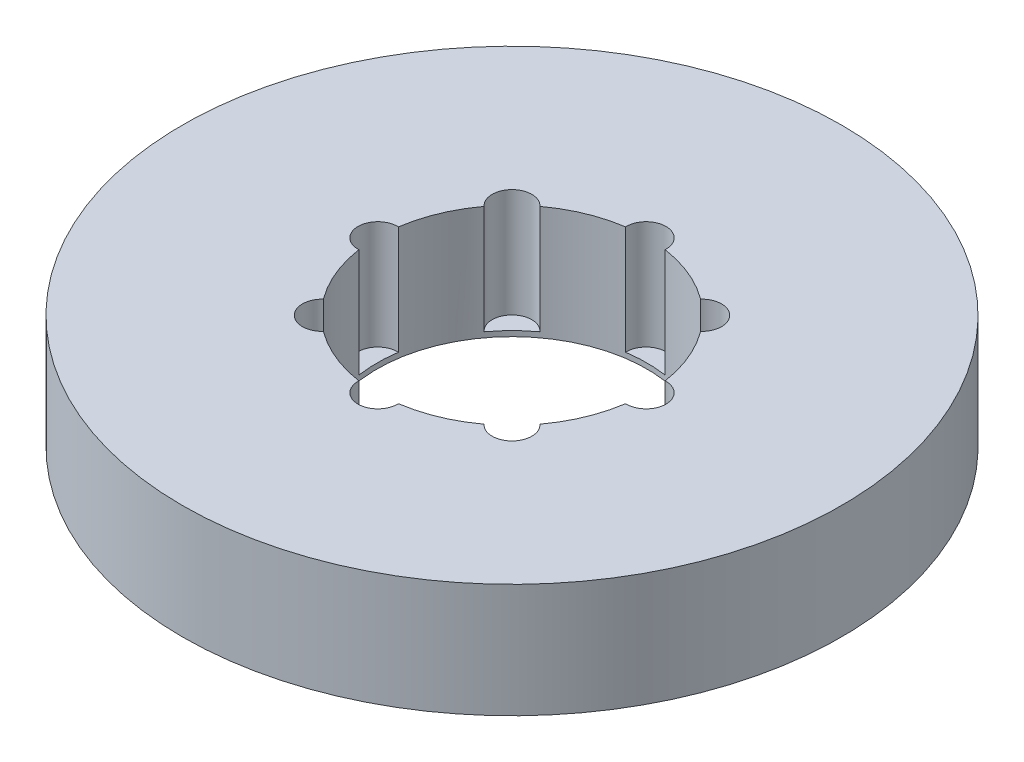
ISO-10303-21;
HEADER;
FILE_DESCRIPTION(('STEP AP214'),'2;1');
FILE_NAME('part.step','',(''),(''),'','','');
FILE_SCHEMA(('AUTOMOTIVE_DESIGN { 1 0 10303 214 1 1 1 1 }'));
ENDSEC;
DATA;
#1=APPLICATION_CONTEXT('core data for automotive mechanical design processes');
#2=APPLICATION_PROTOCOL_DEFINITION('international standard','automotive_design',2000,#1);
#3=PRODUCT_CONTEXT('',#1,'mechanical');
#4=PRODUCT('Part','Part','',(#3));
#5=PRODUCT_RELATED_PRODUCT_CATEGORY('part','',(#4));
#6=PRODUCT_DEFINITION_FORMATION('','',#4);
#7=PRODUCT_DEFINITION_CONTEXT('part definition',#1,'design');
#8=PRODUCT_DEFINITION('design','',#6,#7);
#9=PRODUCT_DEFINITION_SHAPE('','',#8);
#10=(LENGTH_UNIT() NAMED_UNIT(*) SI_UNIT(.MILLI.,.METRE.));
#11=(NAMED_UNIT(*) PLANE_ANGLE_UNIT() SI_UNIT($,.RADIAN.));
#12=(NAMED_UNIT(*) SI_UNIT($,.STERADIAN.) SOLID_ANGLE_UNIT());
#13=UNCERTAINTY_MEASURE_WITH_UNIT(LENGTH_MEASURE(1.E-05),#10,'distance_accuracy_value','');
#14=(GEOMETRIC_REPRESENTATION_CONTEXT(3) GLOBAL_UNCERTAINTY_ASSIGNED_CONTEXT((#13)) GLOBAL_UNIT_ASSIGNED_CONTEXT((#10,
#11,#12)) REPRESENTATION_CONTEXT('',''));
#15=CARTESIAN_POINT('',(0.,0.,0.));
#16=DIRECTION('',(0.,0.,1.));
#17=DIRECTION('',(1.,0.,0.));
#18=AXIS2_PLACEMENT_3D('',#15,#16,#17);
#19=CARTESIAN_POINT('',(0.,19.,0.));
#20=DIRECTION('',(0.,-1.,0.));
#21=DIRECTION('',(0.,0.,-1.));
#22=AXIS2_PLACEMENT_3D('',#19,#20,#21);
#23=CYLINDRICAL_SURFACE('',#22,55.);
#24=CARTESIAN_POINT('',(0.,19.,0.));
#25=DIRECTION('',(0.,1.,0.));
#26=DIRECTION('',(0.,0.,1.));
#27=AXIS2_PLACEMENT_3D('',#24,#25,#26);
#28=CIRCLE('',#27,55.);
#29=CARTESIAN_POINT('',(0.,19.,55.));
#30=VERTEX_POINT('',#29);
#31=EDGE_CURVE('E195',#30,#30,#28,.T.);
#32=ORIENTED_EDGE('',*,*,#31,.F.);
#33=EDGE_LOOP('',(#32));
#34=FACE_BOUND('',#33,.T.);
#35=CARTESIAN_POINT('',(0.,0.,0.));
#36=DIRECTION('',(0.,1.,0.));
#37=DIRECTION('',(0.,0.,1.));
#38=AXIS2_PLACEMENT_3D('',#35,#36,#37);
#39=CIRCLE('',#38,55.);
#40=CARTESIAN_POINT('',(0.,0.,55.));
#41=VERTEX_POINT('',#40);
#42=EDGE_CURVE('E179',#41,#41,#39,.T.);
#43=ORIENTED_EDGE('',*,*,#42,.T.);
#44=EDGE_LOOP('',(#43));
#45=FACE_BOUND('',#44,.T.);
#46=ADVANCED_FACE('F39',(#34,#45),#23,.T.);
#47=CARTESIAN_POINT('',(0.,19.,0.));
#48=DIRECTION('',(0.,1.,0.));
#49=DIRECTION('',(0.,0.,1.));
#50=AXIS2_PLACEMENT_3D('',#47,#48,#49);
#51=PLANE('',#50);
#52=CARTESIAN_POINT('',(0.,19.,22.3926226197725));
#53=DIRECTION('',(0.,1.,0.));
#54=DIRECTION('',(1.,0.,0.));
#55=AXIS2_PLACEMENT_3D('',#52,#53,#54);
#56=CIRCLE('',#55,3.3011017216078);
#57=CARTESIAN_POINT('',(-3.29831189292121,19.,22.2569346195071));
#58=VERTEX_POINT('',#57);
#59=CARTESIAN_POINT('',(3.29831189292136,19.,22.2569346195071));
#60=VERTEX_POINT('',#59);
#61=EDGE_CURVE('E176',#58,#60,#56,.T.);
#62=ORIENTED_EDGE('',*,*,#61,.F.);
#63=CARTESIAN_POINT('',(0.,19.,0.));
#64=DIRECTION('',(0.,1.,0.));
#65=DIRECTION('',(0.,0.,1.));
#66=AXIS2_PLACEMENT_3D('',#63,#64,#65);
#67=CIRCLE('',#66,22.5);
#68=CARTESIAN_POINT('',(-13.4057706919262,19.,18.070288103832));
#69=VERTEX_POINT('',#68);
#70=EDGE_CURVE('E166',#69,#58,#67,.T.);
#71=ORIENTED_EDGE('',*,*,#70,.F.);
#72=CARTESIAN_POINT('',(-15.8339753029924,19.,15.8339753029924));
#73=DIRECTION('',(0.,1.,0.));
#74=DIRECTION('',(0.707106781186549,0.,0.707106781186546));
#75=AXIS2_PLACEMENT_3D('',#72,#73,#74);
#76=CIRCLE('',#75,3.3011017216078);
#77=CARTESIAN_POINT('',(-18.070288103832,19.,13.4057706919263));
#78=VERTEX_POINT('',#77);
#79=EDGE_CURVE('E147',#78,#69,#76,.T.);
#80=ORIENTED_EDGE('',*,*,#79,.F.);
#81=CARTESIAN_POINT('',(-22.2569346195071,19.,3.29831189292129));
#82=VERTEX_POINT('',#81);
#83=EDGE_CURVE('E180',#82,#78,#67,.T.);
#84=ORIENTED_EDGE('',*,*,#83,.F.);
#85=CARTESIAN_POINT('',(-22.3926226197725,19.,0.));
#86=DIRECTION('',(0.,1.,0.));
#87=DIRECTION('',(0.,0.,1.));
#88=AXIS2_PLACEMENT_3D('',#85,#86,#87);
#89=CIRCLE('',#88,3.3011017216078);
#90=CARTESIAN_POINT('',(-22.2569346195071,19.,-3.29831189292129));
#91=VERTEX_POINT('',#90);
#92=EDGE_CURVE('E186',#91,#82,#89,.T.);
#93=ORIENTED_EDGE('',*,*,#92,.F.);
#94=CARTESIAN_POINT('',(-18.0702881038322,19.,-13.405770691926));
#95=VERTEX_POINT('',#94);
#96=EDGE_CURVE('E182',#95,#91,#67,.T.);
#97=ORIENTED_EDGE('',*,*,#96,.F.);
#98=CARTESIAN_POINT('',(-15.8339753029926,19.,-15.8339753029922));
#99=DIRECTION('',(0.,1.,0.));
#100=DIRECTION('',(-0.707106781186539,0.,0.707106781186556));
#101=AXIS2_PLACEMENT_3D('',#98,#99,#100);
#102=CIRCLE('',#101,3.3011017216078);
#103=CARTESIAN_POINT('',(-13.4057706919264,19.,-18.0702881038318));
#104=VERTEX_POINT('',#103);
#105=EDGE_CURVE('E446',#104,#95,#102,.T.);
#106=ORIENTED_EDGE('',*,*,#105,.F.);
#107=CARTESIAN_POINT('',(-3.29831189292152,19.,-22.2569346195071));
#108=VERTEX_POINT('',#107);
#109=EDGE_CURVE('E452',#108,#104,#67,.T.);
#110=ORIENTED_EDGE('',*,*,#109,.F.);
#111=CARTESIAN_POINT('',(-2.34550272014077E-13,19.,-22.3926226197725));
#112=DIRECTION('',(0.,1.,0.));
#113=DIRECTION('',(-1.,0.,0.));
#114=AXIS2_PLACEMENT_3D('',#111,#112,#113);
#115=CIRCLE('',#114,3.3011017216078);
#116=CARTESIAN_POINT('',(3.29831189292105,19.,-22.2569346195071));
#117=VERTEX_POINT('',#116);
#118=EDGE_CURVE('E477',#117,#108,#115,.T.);
#119=ORIENTED_EDGE('',*,*,#118,.F.);
#120=CARTESIAN_POINT('',(13.4057706919261,19.,-18.0702881038321));
#121=VERTEX_POINT('',#120);
#122=EDGE_CURVE('E460',#121,#117,#67,.T.);
#123=ORIENTED_EDGE('',*,*,#122,.F.);
#124=CARTESIAN_POINT('',(15.8339753029923,19.,-15.8339753029925));
#125=DIRECTION('',(0.,1.,0.));
#126=DIRECTION('',(-0.707106781186554,0.,-0.707106781186541));
#127=AXIS2_PLACEMENT_3D('',#124,#125,#126);
#128=CIRCLE('',#127,3.3011017216078);
#129=CARTESIAN_POINT('',(18.0702881038319,19.,-13.4057706919264));
#130=VERTEX_POINT('',#129);
#131=EDGE_CURVE('E464',#130,#121,#128,.T.);
#132=ORIENTED_EDGE('',*,*,#131,.F.);
#133=CARTESIAN_POINT('',(22.2569346195071,19.,-3.29831189292129));
#134=VERTEX_POINT('',#133);
#135=EDGE_CURVE('E459',#134,#130,#67,.T.);
#136=ORIENTED_EDGE('',*,*,#135,.F.);
#137=CARTESIAN_POINT('',(22.3926226197725,19.,0.));
#138=DIRECTION('',(0.,1.,0.));
#139=DIRECTION('',(0.,0.,-1.));
#140=AXIS2_PLACEMENT_3D('',#137,#138,#139);
#141=CIRCLE('',#140,3.3011017216078);
#142=CARTESIAN_POINT('',(22.2569346195071,19.,3.29831189292129));
#143=VERTEX_POINT('',#142);
#144=EDGE_CURVE('E469',#143,#134,#141,.T.);
#145=ORIENTED_EDGE('',*,*,#144,.F.);
#146=CARTESIAN_POINT('',(18.0702881038321,19.,13.4057706919261));
#147=VERTEX_POINT('',#146);
#148=EDGE_CURVE('E181',#147,#143,#67,.T.);
#149=ORIENTED_EDGE('',*,*,#148,.F.);
#150=CARTESIAN_POINT('',(15.8339753029925,19.,15.8339753029923));
#151=DIRECTION('',(0.,1.,0.));
#152=DIRECTION('',(0.707106781186544,0.,-0.707106781186551));
#153=AXIS2_PLACEMENT_3D('',#150,#151,#152);
#154=CIRCLE('',#153,3.3011017216078);
#155=CARTESIAN_POINT('',(13.4057706919263,19.,18.0702881038319));
#156=VERTEX_POINT('',#155);
#157=EDGE_CURVE('E475',#156,#147,#154,.T.);
#158=ORIENTED_EDGE('',*,*,#157,.F.);
#159=EDGE_CURVE('E177',#60,#156,#67,.T.);
#160=ORIENTED_EDGE('',*,*,#159,.F.);
#161=EDGE_LOOP('',(#62,#71,#80,#84,#93,#97,#106,#110,#119,#123,#132,#136,#145,#149,#158,#160));
#162=FACE_BOUND('',#161,.T.);
#163=ORIENTED_EDGE('',*,*,#31,.T.);
#164=EDGE_LOOP('',(#163));
#165=FACE_BOUND('',#164,.T.);
#166=ADVANCED_FACE('F172',(#162,#165),#51,.T.);
#167=CARTESIAN_POINT('',(0.,0.,0.));
#168=DIRECTION('',(0.,1.,0.));
#169=DIRECTION('',(0.,0.,1.));
#170=AXIS2_PLACEMENT_3D('',#167,#168,#169);
#171=PLANE('',#170);
#172=CARTESIAN_POINT('',(0.,0.,0.));
#173=DIRECTION('',(0.,1.,0.));
#174=DIRECTION('',(0.,0.,1.));
#175=AXIS2_PLACEMENT_3D('',#172,#173,#174);
#176=CIRCLE('',#175,22.5);
#177=CARTESIAN_POINT('',(0.,0.,22.5));
#178=VERTEX_POINT('',#177);
#179=EDGE_CURVE('E187',#178,#178,#176,.T.);
#180=ORIENTED_EDGE('',*,*,#179,.T.);
#181=EDGE_LOOP('',(#180));
#182=FACE_BOUND('',#181,.T.);
#183=ORIENTED_EDGE('',*,*,#42,.F.);
#184=EDGE_LOOP('',(#183));
#185=FACE_BOUND('',#184,.T.);
#186=ADVANCED_FACE('F270',(#182,#185),#171,.F.);
#187=CARTESIAN_POINT('',(0.,19.,0.));
#188=DIRECTION('',(0.,-1.,0.));
#189=DIRECTION('',(0.,0.,-1.));
#190=AXIS2_PLACEMENT_3D('',#187,#188,#189);
#191=CYLINDRICAL_SURFACE('',#190,22.5);
#192=DIRECTION('',(0.,1.,0.));
#193=VECTOR('',#192,1.);
#194=CARTESIAN_POINT('',(-3.29831189292121,9.93913205684937,22.2569346195071));
#195=LINE('',#194,#193);
#196=CARTESIAN_POINT('',(-3.29831189292121,0.878264113698735,22.2569346195071));
#197=VERTEX_POINT('',#196);
#198=EDGE_CURVE('E11',#197,#58,#195,.T.);
#199=ORIENTED_EDGE('',*,*,#198,.F.);
#200=CARTESIAN_POINT('',(0.,0.878264113698735,0.));
#201=DIRECTION('',(0.,1.,0.));
#202=DIRECTION('',(0.,0.,1.));
#203=AXIS2_PLACEMENT_3D('',#200,#201,#202);
#204=CIRCLE('',#203,22.5);
#205=CARTESIAN_POINT('',(3.29831189292136,0.878264113698735,22.2569346195071));
#206=VERTEX_POINT('',#205);
#207=EDGE_CURVE('E250',#197,#206,#204,.T.);
#208=ORIENTED_EDGE('',*,*,#207,.T.);
#209=DIRECTION('',(0.,1.,0.));
#210=VECTOR('',#209,1.);
#211=CARTESIAN_POINT('',(3.29831189292136,9.93913205684937,22.2569346195071));
#212=LINE('',#211,#210);
#213=EDGE_CURVE('E46',#60,#206,#212,.F.);
#214=ORIENTED_EDGE('',*,*,#213,.F.);
#215=ORIENTED_EDGE('',*,*,#159,.T.);
#216=DIRECTION('',(0.,1.,0.));
#217=VECTOR('',#216,1.);
#218=CARTESIAN_POINT('',(13.4057706919263,9.93913205684937,18.0702881038319));
#219=LINE('',#218,#217);
#220=CARTESIAN_POINT('',(13.4057706919263,0.878264113698735,18.0702881038319));
#221=VERTEX_POINT('',#220);
#222=EDGE_CURVE('E244',#221,#156,#219,.T.);
#223=ORIENTED_EDGE('',*,*,#222,.F.);
#224=CARTESIAN_POINT('',(0.,0.878264113698735,0.));
#225=DIRECTION('',(0.,1.,0.));
#226=DIRECTION('',(0.,0.,1.));
#227=AXIS2_PLACEMENT_3D('',#224,#225,#226);
#228=CIRCLE('',#227,22.5);
#229=CARTESIAN_POINT('',(18.0702881038321,0.878264113698735,13.4057706919261));
#230=VERTEX_POINT('',#229);
#231=EDGE_CURVE('E238',#221,#230,#228,.T.);
#232=ORIENTED_EDGE('',*,*,#231,.T.);
#233=DIRECTION('',(0.,1.,0.));
#234=VECTOR('',#233,1.);
#235=CARTESIAN_POINT('',(18.0702881038321,9.93913205684937,13.4057706919261));
#236=LINE('',#235,#234);
#237=EDGE_CURVE('E242',#147,#230,#236,.F.);
#238=ORIENTED_EDGE('',*,*,#237,.F.);
#239=ORIENTED_EDGE('',*,*,#148,.T.);
#240=DIRECTION('',(0.,1.,0.));
#241=VECTOR('',#240,1.);
#242=CARTESIAN_POINT('',(22.2569346195071,9.93913205684937,3.29831189292129));
#243=LINE('',#242,#241);
#244=CARTESIAN_POINT('',(22.2569346195071,0.878264113698735,3.29831189292129));
#245=VERTEX_POINT('',#244);
#246=EDGE_CURVE('E236',#245,#143,#243,.T.);
#247=ORIENTED_EDGE('',*,*,#246,.F.);
#248=CARTESIAN_POINT('',(0.,0.878264113698735,0.));
#249=DIRECTION('',(0.,1.,0.));
#250=DIRECTION('',(0.,0.,1.));
#251=AXIS2_PLACEMENT_3D('',#248,#249,#250);
#252=CIRCLE('',#251,22.5);
#253=CARTESIAN_POINT('',(22.2569346195071,0.878264113698735,-3.29831189292129));
#254=VERTEX_POINT('',#253);
#255=EDGE_CURVE('E235',#245,#254,#252,.T.);
#256=ORIENTED_EDGE('',*,*,#255,.T.);
#257=DIRECTION('',(0.,1.,0.));
#258=VECTOR('',#257,1.);
#259=CARTESIAN_POINT('',(22.2569346195071,9.93913205684937,-3.29831189292129));
#260=LINE('',#259,#258);
#261=EDGE_CURVE('E234',#134,#254,#260,.F.);
#262=ORIENTED_EDGE('',*,*,#261,.F.);
#263=ORIENTED_EDGE('',*,*,#135,.T.);
#264=DIRECTION('',(0.,1.,0.));
#265=VECTOR('',#264,1.);
#266=CARTESIAN_POINT('',(18.0702881038319,9.93913205684937,-13.4057706919264));
#267=LINE('',#266,#265);
#268=CARTESIAN_POINT('',(18.0702881038319,0.878264113698735,-13.4057706919264));
#269=VERTEX_POINT('',#268);
#270=EDGE_CURVE('E229',#269,#130,#267,.T.);
#271=ORIENTED_EDGE('',*,*,#270,.F.);
#272=CARTESIAN_POINT('',(0.,0.878264113698735,0.));
#273=DIRECTION('',(0.,1.,0.));
#274=DIRECTION('',(0.,0.,1.));
#275=AXIS2_PLACEMENT_3D('',#272,#273,#274);
#276=CIRCLE('',#275,22.5);
#277=CARTESIAN_POINT('',(13.4057706919261,0.878264113698735,-18.0702881038321));
#278=VERTEX_POINT('',#277);
#279=EDGE_CURVE('E221',#269,#278,#276,.T.);
#280=ORIENTED_EDGE('',*,*,#279,.T.);
#281=DIRECTION('',(0.,1.,0.));
#282=VECTOR('',#281,1.);
#283=CARTESIAN_POINT('',(13.4057706919261,9.93913205684937,-18.0702881038321));
#284=LINE('',#283,#282);
#285=EDGE_CURVE('E230',#121,#278,#284,.F.);
#286=ORIENTED_EDGE('',*,*,#285,.F.);
#287=ORIENTED_EDGE('',*,*,#122,.T.);
#288=DIRECTION('',(0.,1.,0.));
#289=VECTOR('',#288,1.);
#290=CARTESIAN_POINT('',(3.29831189292105,9.93913205684937,-22.2569346195071));
#291=LINE('',#290,#289);
#292=CARTESIAN_POINT('',(3.29831189292105,0.878264113698735,-22.2569346195071));
#293=VERTEX_POINT('',#292);
#294=EDGE_CURVE('E225',#293,#117,#291,.T.);
#295=ORIENTED_EDGE('',*,*,#294,.F.);
#296=CARTESIAN_POINT('',(0.,0.878264113698735,0.));
#297=DIRECTION('',(0.,1.,0.));
#298=DIRECTION('',(0.,0.,1.));
#299=AXIS2_PLACEMENT_3D('',#296,#297,#298);
#300=CIRCLE('',#299,22.5);
#301=CARTESIAN_POINT('',(-3.29831189292152,0.878264113698735,-22.2569346195071));
#302=VERTEX_POINT('',#301);
#303=EDGE_CURVE('E216',#293,#302,#300,.T.);
#304=ORIENTED_EDGE('',*,*,#303,.T.);
#305=DIRECTION('',(0.,1.,0.));
#306=VECTOR('',#305,1.);
#307=CARTESIAN_POINT('',(-3.29831189292152,9.93913205684937,-22.2569346195071));
#308=LINE('',#307,#306);
#309=EDGE_CURVE('E218',#108,#302,#308,.F.);
#310=ORIENTED_EDGE('',*,*,#309,.F.);
#311=ORIENTED_EDGE('',*,*,#109,.T.);
#312=DIRECTION('',(0.,1.,0.));
#313=VECTOR('',#312,1.);
#314=CARTESIAN_POINT('',(-13.4057706919264,9.93913205684937,-18.0702881038318));
#315=LINE('',#314,#313);
#316=CARTESIAN_POINT('',(-13.4057706919264,0.878264113698735,-18.0702881038318));
#317=VERTEX_POINT('',#316);
#318=EDGE_CURVE('E212',#317,#104,#315,.T.);
#319=ORIENTED_EDGE('',*,*,#318,.F.);
#320=CARTESIAN_POINT('',(0.,0.878264113698735,0.));
#321=DIRECTION('',(0.,1.,0.));
#322=DIRECTION('',(0.,0.,1.));
#323=AXIS2_PLACEMENT_3D('',#320,#321,#322);
#324=CIRCLE('',#323,22.5);
#325=CARTESIAN_POINT('',(-18.0702881038322,0.878264113698735,-13.405770691926));
#326=VERTEX_POINT('',#325);
#327=EDGE_CURVE('E208',#317,#326,#324,.T.);
#328=ORIENTED_EDGE('',*,*,#327,.T.);
#329=DIRECTION('',(0.,1.,0.));
#330=VECTOR('',#329,1.);
#331=CARTESIAN_POINT('',(-18.0702881038322,9.93913205684937,-13.405770691926));
#332=LINE('',#331,#330);
#333=EDGE_CURVE('E211',#95,#326,#332,.F.);
#334=ORIENTED_EDGE('',*,*,#333,.F.);
#335=ORIENTED_EDGE('',*,*,#96,.T.);
#336=DIRECTION('',(0.,1.,0.));
#337=VECTOR('',#336,1.);
#338=CARTESIAN_POINT('',(-22.2569346195071,9.93913205684937,-3.29831189292129));
#339=LINE('',#338,#337);
#340=CARTESIAN_POINT('',(-22.2569346195071,0.878264113698735,-3.29831189292129));
#341=VERTEX_POINT('',#340);
#342=EDGE_CURVE('E201',#341,#91,#339,.T.);
#343=ORIENTED_EDGE('',*,*,#342,.F.);
#344=CARTESIAN_POINT('',(0.,0.878264113698735,0.));
#345=DIRECTION('',(0.,1.,0.));
#346=DIRECTION('',(0.,0.,1.));
#347=AXIS2_PLACEMENT_3D('',#344,#345,#346);
#348=CIRCLE('',#347,22.5);
#349=CARTESIAN_POINT('',(-22.2569346195071,0.878264113698735,3.29831189292129));
#350=VERTEX_POINT('',#349);
#351=EDGE_CURVE('E194',#341,#350,#348,.T.);
#352=ORIENTED_EDGE('',*,*,#351,.T.);
#353=DIRECTION('',(0.,1.,0.));
#354=VECTOR('',#353,1.);
#355=CARTESIAN_POINT('',(-22.2569346195071,9.93913205684937,3.29831189292129));
#356=LINE('',#355,#354);
#357=EDGE_CURVE('E199',#82,#350,#356,.F.);
#358=ORIENTED_EDGE('',*,*,#357,.F.);
#359=ORIENTED_EDGE('',*,*,#83,.T.);
#360=DIRECTION('',(0.,1.,0.));
#361=VECTOR('',#360,1.);
#362=CARTESIAN_POINT('',(-18.070288103832,9.93913205684937,13.4057706919263));
#363=LINE('',#362,#361);
#364=CARTESIAN_POINT('',(-18.070288103832,0.878264113698735,13.4057706919263));
#365=VERTEX_POINT('',#364);
#366=EDGE_CURVE('E160',#365,#78,#363,.T.);
#367=ORIENTED_EDGE('',*,*,#366,.F.);
#368=CARTESIAN_POINT('',(0.,0.878264113698735,0.));
#369=DIRECTION('',(0.,1.,0.));
#370=DIRECTION('',(0.,0.,1.));
#371=AXIS2_PLACEMENT_3D('',#368,#369,#370);
#372=CIRCLE('',#371,22.5);
#373=CARTESIAN_POINT('',(-13.4057706919262,0.878264113698735,18.070288103832));
#374=VERTEX_POINT('',#373);
#375=EDGE_CURVE('E168',#365,#374,#372,.T.);
#376=ORIENTED_EDGE('',*,*,#375,.T.);
#377=DIRECTION('',(0.,1.,0.));
#378=VECTOR('',#377,1.);
#379=CARTESIAN_POINT('',(-13.4057706919262,9.93913205684937,18.070288103832));
#380=LINE('',#379,#378);
#381=EDGE_CURVE('E152',#69,#374,#380,.F.);
#382=ORIENTED_EDGE('',*,*,#381,.F.);
#383=ORIENTED_EDGE('',*,*,#70,.T.);
#384=EDGE_LOOP('',(#199,#208,#214,#215,#223,#232,#238,#239,#247,#256,#262,#263,#271,#280,#286,
#287,#295,#304,#310,#311,#319,#328,#334,#335,#343,#352,#358,#359,#367,#376,#382,#383));
#385=FACE_BOUND('',#384,.T.);
#386=ORIENTED_EDGE('',*,*,#179,.F.);
#387=EDGE_LOOP('',(#386));
#388=FACE_BOUND('',#387,.T.);
#389=ADVANCED_FACE('F170',(#385,#388),#191,.F.);
#390=CARTESIAN_POINT('',(-22.3926226197725,0.878264113698735,0.));
#391=DIRECTION('',(0.,1.,0.));
#392=DIRECTION('',(0.,0.,1.));
#393=AXIS2_PLACEMENT_3D('',#390,#391,#392);
#394=CYLINDRICAL_SURFACE('',#393,3.3011017216078);
#395=ORIENTED_EDGE('',*,*,#342,.T.);
#396=ORIENTED_EDGE('',*,*,#92,.T.);
#397=ORIENTED_EDGE('',*,*,#357,.T.);
#398=CARTESIAN_POINT('',(-22.3926226197725,0.878264113698735,0.));
#399=DIRECTION('',(0.,1.,0.));
#400=DIRECTION('',(0.,0.,1.));
#401=AXIS2_PLACEMENT_3D('',#398,#399,#400);
#402=CIRCLE('',#401,3.3011017216078);
#403=EDGE_CURVE('E191',#341,#350,#402,.T.);
#404=ORIENTED_EDGE('',*,*,#403,.F.);
#405=EDGE_LOOP('',(#395,#396,#397,#404));
#406=FACE_BOUND('',#405,.T.);
#407=ADVANCED_FACE('F279',(#406),#394,.F.);
#408=CARTESIAN_POINT('',(-22.3926226197725,0.878264113698735,0.));
#409=DIRECTION('',(0.,1.,0.));
#410=DIRECTION('',(0.,0.,1.));
#411=AXIS2_PLACEMENT_3D('',#408,#409,#410);
#412=PLANE('',#411);
#413=ORIENTED_EDGE('',*,*,#403,.T.);
#414=ORIENTED_EDGE('',*,*,#351,.F.);
#415=EDGE_LOOP('',(#413,#414));
#416=FACE_BOUND('',#415,.T.);
#417=ADVANCED_FACE('F285',(#416),#412,.T.);
#418=CARTESIAN_POINT('',(-15.8339753029924,0.878264113698735,15.8339753029924));
#419=DIRECTION('',(0.,1.,0.));
#420=DIRECTION('',(0.,0.,1.));
#421=AXIS2_PLACEMENT_3D('',#418,#419,#420);
#422=CYLINDRICAL_SURFACE('',#421,3.3011017216078);
#423=ORIENTED_EDGE('',*,*,#366,.T.);
#424=ORIENTED_EDGE('',*,*,#79,.T.);
#425=ORIENTED_EDGE('',*,*,#381,.T.);
#426=CARTESIAN_POINT('',(-15.8339753029924,0.878264113698735,15.8339753029924));
#427=DIRECTION('',(0.,1.,0.));
#428=DIRECTION('',(0.707106781186549,0.,0.707106781186546));
#429=AXIS2_PLACEMENT_3D('',#426,#427,#428);
#430=CIRCLE('',#429,3.3011017216078);
#431=EDGE_CURVE('E165',#365,#374,#430,.T.);
#432=ORIENTED_EDGE('',*,*,#431,.F.);
#433=EDGE_LOOP('',(#423,#424,#425,#432));
#434=FACE_BOUND('',#433,.T.);
#435=ADVANCED_FACE('F155',(#434),#422,.F.);
#436=CARTESIAN_POINT('',(-15.8339753029924,0.878264113698735,15.8339753029924));
#437=DIRECTION('',(0.,1.,0.));
#438=DIRECTION('',(0.707106781186549,0.,0.707106781186546));
#439=AXIS2_PLACEMENT_3D('',#436,#437,#438);
#440=PLANE('',#439);
#441=ORIENTED_EDGE('',*,*,#431,.T.);
#442=ORIENTED_EDGE('',*,*,#375,.F.);
#443=EDGE_LOOP('',(#441,#442));
#444=FACE_BOUND('',#443,.T.);
#445=ADVANCED_FACE('F288',(#444),#440,.T.);
#446=CARTESIAN_POINT('',(-15.8339753029926,0.878264113698735,-15.8339753029922));
#447=DIRECTION('',(0.,1.,0.));
#448=DIRECTION('',(0.,0.,1.));
#449=AXIS2_PLACEMENT_3D('',#446,#447,#448);
#450=CYLINDRICAL_SURFACE('',#449,3.3011017216078);
#451=ORIENTED_EDGE('',*,*,#318,.T.);
#452=ORIENTED_EDGE('',*,*,#105,.T.);
#453=ORIENTED_EDGE('',*,*,#333,.T.);
#454=CARTESIAN_POINT('',(-15.8339753029926,0.878264113698735,-15.8339753029922));
#455=DIRECTION('',(0.,1.,0.));
#456=DIRECTION('',(-0.707106781186539,0.,0.707106781186556));
#457=AXIS2_PLACEMENT_3D('',#454,#455,#456);
#458=CIRCLE('',#457,3.3011017216078);
#459=EDGE_CURVE('E447',#317,#326,#458,.T.);
#460=ORIENTED_EDGE('',*,*,#459,.F.);
#461=EDGE_LOOP('',(#451,#452,#453,#460));
#462=FACE_BOUND('',#461,.T.);
#463=ADVANCED_FACE('F295',(#462),#450,.F.);
#464=CARTESIAN_POINT('',(-15.8339753029926,0.878264113698735,-15.8339753029922));
#465=DIRECTION('',(0.,1.,0.));
#466=DIRECTION('',(-0.707106781186539,0.,0.707106781186556));
#467=AXIS2_PLACEMENT_3D('',#464,#465,#466);
#468=PLANE('',#467);
#469=ORIENTED_EDGE('',*,*,#459,.T.);
#470=ORIENTED_EDGE('',*,*,#327,.F.);
#471=EDGE_LOOP('',(#469,#470));
#472=FACE_BOUND('',#471,.T.);
#473=ADVANCED_FACE('F375',(#472),#468,.T.);
#474=CARTESIAN_POINT('',(-2.34550272014077E-13,0.878264113698735,-22.3926226197725));
#475=DIRECTION('',(0.,1.,0.));
#476=DIRECTION('',(0.,0.,1.));
#477=AXIS2_PLACEMENT_3D('',#474,#475,#476);
#478=CYLINDRICAL_SURFACE('',#477,3.3011017216078);
#479=ORIENTED_EDGE('',*,*,#294,.T.);
#480=ORIENTED_EDGE('',*,*,#118,.T.);
#481=ORIENTED_EDGE('',*,*,#309,.T.);
#482=CARTESIAN_POINT('',(-2.34550272014077E-13,0.878264113698735,-22.3926226197725));
#483=DIRECTION('',(0.,1.,0.));
#484=DIRECTION('',(-1.,0.,0.));
#485=AXIS2_PLACEMENT_3D('',#482,#483,#484);
#486=CIRCLE('',#485,3.3011017216078);
#487=EDGE_CURVE('E467',#293,#302,#486,.T.);
#488=ORIENTED_EDGE('',*,*,#487,.F.);
#489=EDGE_LOOP('',(#479,#480,#481,#488));
#490=FACE_BOUND('',#489,.T.);
#491=ADVANCED_FACE('F361',(#490),#478,.F.);
#492=CARTESIAN_POINT('',(-2.34550272014077E-13,0.878264113698735,-22.3926226197725));
#493=DIRECTION('',(0.,1.,0.));
#494=DIRECTION('',(-1.,0.,0.));
#495=AXIS2_PLACEMENT_3D('',#492,#493,#494);
#496=PLANE('',#495);
#497=ORIENTED_EDGE('',*,*,#487,.T.);
#498=ORIENTED_EDGE('',*,*,#303,.F.);
#499=EDGE_LOOP('',(#497,#498));
#500=FACE_BOUND('',#499,.T.);
#501=ADVANCED_FACE('F297',(#500),#496,.T.);
#502=CARTESIAN_POINT('',(15.8339753029923,0.878264113698735,-15.8339753029925));
#503=DIRECTION('',(0.,1.,0.));
#504=DIRECTION('',(0.,0.,1.));
#505=AXIS2_PLACEMENT_3D('',#502,#503,#504);
#506=CYLINDRICAL_SURFACE('',#505,3.3011017216078);
#507=ORIENTED_EDGE('',*,*,#270,.T.);
#508=ORIENTED_EDGE('',*,*,#131,.T.);
#509=ORIENTED_EDGE('',*,*,#285,.T.);
#510=CARTESIAN_POINT('',(15.8339753029923,0.878264113698735,-15.8339753029925));
#511=DIRECTION('',(0.,1.,0.));
#512=DIRECTION('',(-0.707106781186554,0.,-0.707106781186541));
#513=AXIS2_PLACEMENT_3D('',#510,#511,#512);
#514=CIRCLE('',#513,3.3011017216078);
#515=EDGE_CURVE('E470',#269,#278,#514,.T.);
#516=ORIENTED_EDGE('',*,*,#515,.F.);
#517=EDGE_LOOP('',(#507,#508,#509,#516));
#518=FACE_BOUND('',#517,.T.);
#519=ADVANCED_FACE('F294',(#518),#506,.F.);
#520=CARTESIAN_POINT('',(15.8339753029923,0.878264113698735,-15.8339753029925));
#521=DIRECTION('',(0.,1.,0.));
#522=DIRECTION('',(-0.707106781186554,0.,-0.707106781186541));
#523=AXIS2_PLACEMENT_3D('',#520,#521,#522);
#524=PLANE('',#523);
#525=ORIENTED_EDGE('',*,*,#515,.T.);
#526=ORIENTED_EDGE('',*,*,#279,.F.);
#527=EDGE_LOOP('',(#525,#526));
#528=FACE_BOUND('',#527,.T.);
#529=ADVANCED_FACE('F300',(#528),#524,.T.);
#530=CARTESIAN_POINT('',(22.3926226197725,0.878264113698735,0.));
#531=DIRECTION('',(0.,1.,0.));
#532=DIRECTION('',(0.,0.,1.));
#533=AXIS2_PLACEMENT_3D('',#530,#531,#532);
#534=CYLINDRICAL_SURFACE('',#533,3.3011017216078);
#535=ORIENTED_EDGE('',*,*,#246,.T.);
#536=ORIENTED_EDGE('',*,*,#144,.T.);
#537=ORIENTED_EDGE('',*,*,#261,.T.);
#538=CARTESIAN_POINT('',(22.3926226197725,0.878264113698735,0.));
#539=DIRECTION('',(0.,1.,0.));
#540=DIRECTION('',(0.,0.,-1.));
#541=AXIS2_PLACEMENT_3D('',#538,#539,#540);
#542=CIRCLE('',#541,3.3011017216078);
#543=EDGE_CURVE('E472',#245,#254,#542,.T.);
#544=ORIENTED_EDGE('',*,*,#543,.F.);
#545=EDGE_LOOP('',(#535,#536,#537,#544));
#546=FACE_BOUND('',#545,.T.);
#547=ADVANCED_FACE('F305',(#546),#534,.F.);
#548=CARTESIAN_POINT('',(22.3926226197725,0.878264113698735,0.));
#549=DIRECTION('',(0.,1.,0.));
#550=DIRECTION('',(0.,0.,-1.));
#551=AXIS2_PLACEMENT_3D('',#548,#549,#550);
#552=PLANE('',#551);
#553=ORIENTED_EDGE('',*,*,#543,.T.);
#554=ORIENTED_EDGE('',*,*,#255,.F.);
#555=EDGE_LOOP('',(#553,#554));
#556=FACE_BOUND('',#555,.T.);
#557=ADVANCED_FACE('F308',(#556),#552,.T.);
#558=CARTESIAN_POINT('',(15.8339753029925,0.878264113698735,15.8339753029923));
#559=DIRECTION('',(0.,1.,0.));
#560=DIRECTION('',(0.,0.,1.));
#561=AXIS2_PLACEMENT_3D('',#558,#559,#560);
#562=CYLINDRICAL_SURFACE('',#561,3.3011017216078);
#563=ORIENTED_EDGE('',*,*,#222,.T.);
#564=ORIENTED_EDGE('',*,*,#157,.T.);
#565=ORIENTED_EDGE('',*,*,#237,.T.);
#566=CARTESIAN_POINT('',(15.8339753029925,0.878264113698735,15.8339753029923));
#567=DIRECTION('',(0.,1.,0.));
#568=DIRECTION('',(0.707106781186544,0.,-0.707106781186551));
#569=AXIS2_PLACEMENT_3D('',#566,#567,#568);
#570=CIRCLE('',#569,3.3011017216078);
#571=EDGE_CURVE('E56',#221,#230,#570,.T.);
#572=ORIENTED_EDGE('',*,*,#571,.F.);
#573=EDGE_LOOP('',(#563,#564,#565,#572));
#574=FACE_BOUND('',#573,.T.);
#575=ADVANCED_FACE('F309',(#574),#562,.F.);
#576=CARTESIAN_POINT('',(15.8339753029925,0.878264113698735,15.8339753029923));
#577=DIRECTION('',(0.,1.,0.));
#578=DIRECTION('',(0.707106781186544,0.,-0.707106781186551));
#579=AXIS2_PLACEMENT_3D('',#576,#577,#578);
#580=PLANE('',#579);
#581=ORIENTED_EDGE('',*,*,#571,.T.);
#582=ORIENTED_EDGE('',*,*,#231,.F.);
#583=EDGE_LOOP('',(#581,#582));
#584=FACE_BOUND('',#583,.T.);
#585=ADVANCED_FACE('F256',(#584),#580,.T.);
#586=CARTESIAN_POINT('',(0.,0.878264113698735,22.3926226197725));
#587=DIRECTION('',(0.,1.,0.));
#588=DIRECTION('',(0.,0.,1.));
#589=AXIS2_PLACEMENT_3D('',#586,#587,#588);
#590=CYLINDRICAL_SURFACE('',#589,3.3011017216078);
#591=ORIENTED_EDGE('',*,*,#198,.T.);
#592=ORIENTED_EDGE('',*,*,#61,.T.);
#593=ORIENTED_EDGE('',*,*,#213,.T.);
#594=CARTESIAN_POINT('',(0.,0.878264113698735,22.3926226197725));
#595=DIRECTION('',(0.,1.,0.));
#596=DIRECTION('',(1.,0.,0.));
#597=AXIS2_PLACEMENT_3D('',#594,#595,#596);
#598=CIRCLE('',#597,3.3011017216078);
#599=EDGE_CURVE('E55',#197,#206,#598,.T.);
#600=ORIENTED_EDGE('',*,*,#599,.F.);
#601=EDGE_LOOP('',(#591,#592,#593,#600));
#602=FACE_BOUND('',#601,.T.);
#603=ADVANCED_FACE('F253',(#602),#590,.F.);
#604=CARTESIAN_POINT('',(0.,0.878264113698735,22.3926226197725));
#605=DIRECTION('',(0.,1.,0.));
#606=DIRECTION('',(1.,0.,0.));
#607=AXIS2_PLACEMENT_3D('',#604,#605,#606);
#608=PLANE('',#607);
#609=ORIENTED_EDGE('',*,*,#599,.T.);
#610=ORIENTED_EDGE('',*,*,#207,.F.);
#611=EDGE_LOOP('',(#609,#610));
#612=FACE_BOUND('',#611,.T.);
#613=ADVANCED_FACE('F252',(#612),#608,.T.);
#614=CLOSED_SHELL('',(#46,#166,#186,#389,#407,#417,#435,#445,#463,#473,#491,#501,#519,#529,#547,
#557,#575,#585,#603,#613));
#615=MANIFOLD_SOLID_BREP('B2',#614);
#616=ADVANCED_BREP_SHAPE_REPRESENTATION('',(#18,#615),#14);
#617=SHAPE_DEFINITION_REPRESENTATION(#9,#616);
ENDSEC;
END-ISO-10303-21;
